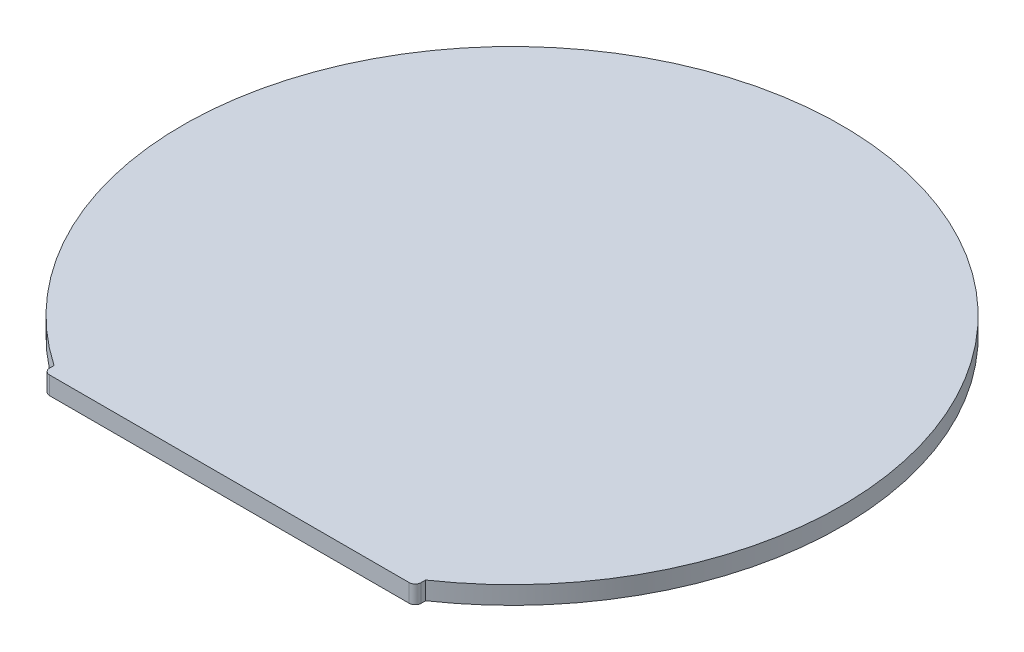
ISO-10303-21;
HEADER;
FILE_DESCRIPTION(('STEP AP214'),'2;1');
FILE_NAME('part.step','',(''),(''),'','','');
FILE_SCHEMA(('AUTOMOTIVE_DESIGN { 1 0 10303 214 1 1 1 1 }'));
ENDSEC;
DATA;
#1=APPLICATION_CONTEXT('core data for automotive mechanical design processes');
#2=APPLICATION_PROTOCOL_DEFINITION('international standard','automotive_design',2000,#1);
#3=PRODUCT_CONTEXT('',#1,'mechanical');
#4=PRODUCT('Part','Part','',(#3));
#5=PRODUCT_RELATED_PRODUCT_CATEGORY('part','',(#4));
#6=PRODUCT_DEFINITION_FORMATION('','',#4);
#7=PRODUCT_DEFINITION_CONTEXT('part definition',#1,'design');
#8=PRODUCT_DEFINITION('design','',#6,#7);
#9=PRODUCT_DEFINITION_SHAPE('','',#8);
#10=(LENGTH_UNIT() NAMED_UNIT(*) SI_UNIT(.MILLI.,.METRE.));
#11=(NAMED_UNIT(*) PLANE_ANGLE_UNIT() SI_UNIT($,.RADIAN.));
#12=(NAMED_UNIT(*) SI_UNIT($,.STERADIAN.) SOLID_ANGLE_UNIT());
#13=UNCERTAINTY_MEASURE_WITH_UNIT(LENGTH_MEASURE(1.E-05),#10,'distance_accuracy_value','');
#14=(GEOMETRIC_REPRESENTATION_CONTEXT(3) GLOBAL_UNCERTAINTY_ASSIGNED_CONTEXT((#13)) GLOBAL_UNIT_ASSIGNED_CONTEXT((#10,
#11,#12)) REPRESENTATION_CONTEXT('',''));
#15=CARTESIAN_POINT('',(0.,0.,0.));
#16=DIRECTION('',(0.,0.,1.));
#17=DIRECTION('',(1.,0.,0.));
#18=AXIS2_PLACEMENT_3D('',#15,#16,#17);
#19=CARTESIAN_POINT('',(-15.5,1.5,23.5849528301415));
#20=DIRECTION('',(1.,0.,0.));
#21=DIRECTION('',(0.,0.,-1.));
#22=AXIS2_PLACEMENT_3D('',#19,#20,#21);
#23=PLANE('',#22);
#24=DIRECTION('',(0.,0.,1.));
#25=VECTOR('',#24,1.);
#26=CARTESIAN_POINT('',(-15.5,0.,23.5849528301415));
#27=LINE('',#26,#25);
#28=CARTESIAN_POINT('',(-15.5,0.,22.7156333832011));
#29=VERTEX_POINT('',#28);
#30=CARTESIAN_POINT('',(-15.5,0.,23.0849528301415));
#31=VERTEX_POINT('',#30);
#32=EDGE_CURVE('E132',#29,#31,#27,.T.);
#33=ORIENTED_EDGE('',*,*,#32,.T.);
#34=DIRECTION('',(0.,-1.,0.));
#35=VECTOR('',#34,1.);
#36=CARTESIAN_POINT('',(-15.5,1.5,23.0849528301415));
#37=LINE('',#36,#35);
#38=CARTESIAN_POINT('',(-15.5,1.5,23.0849528301415));
#39=VERTEX_POINT('',#38);
#40=EDGE_CURVE('E11',#31,#39,#37,.F.);
#41=ORIENTED_EDGE('',*,*,#40,.T.);
#42=DIRECTION('',(0.,0.,1.));
#43=VECTOR('',#42,1.);
#44=CARTESIAN_POINT('',(-15.5,1.5,23.5849528301415));
#45=LINE('',#44,#43);
#46=CARTESIAN_POINT('',(-15.5,1.5,22.7156333832011));
#47=VERTEX_POINT('',#46);
#48=EDGE_CURVE('E142',#47,#39,#45,.T.);
#49=ORIENTED_EDGE('',*,*,#48,.F.);
#50=DIRECTION('',(0.,-1.,0.));
#51=VECTOR('',#50,1.);
#52=CARTESIAN_POINT('',(-15.5,1.5,22.7156333832011));
#53=LINE('',#52,#51);
#54=EDGE_CURVE('E122',#47,#29,#53,.T.);
#55=ORIENTED_EDGE('',*,*,#54,.T.);
#56=EDGE_LOOP('',(#33,#41,#49,#55));
#57=FACE_BOUND('',#56,.T.);
#58=ADVANCED_FACE('F45',(#57),#23,.F.);
#59=CARTESIAN_POINT('',(-15.5,1.5,23.5849528301415));
#60=DIRECTION('',(0.,0.,-1.));
#61=DIRECTION('',(-1.,0.,0.));
#62=AXIS2_PLACEMENT_3D('',#59,#60,#61);
#63=PLANE('',#62);
#64=DIRECTION('',(1.,0.,0.));
#65=VECTOR('',#64,1.);
#66=CARTESIAN_POINT('',(-15.5,0.,23.5849528301415));
#67=LINE('',#66,#65);
#68=CARTESIAN_POINT('',(-15.,0.,23.5849528301415));
#69=VERTEX_POINT('',#68);
#70=CARTESIAN_POINT('',(15.,0.,23.5849528301415));
#71=VERTEX_POINT('',#70);
#72=EDGE_CURVE('E135',#69,#71,#67,.T.);
#73=ORIENTED_EDGE('',*,*,#72,.T.);
#74=DIRECTION('',(0.,-1.,0.));
#75=VECTOR('',#74,1.);
#76=CARTESIAN_POINT('',(15.,1.5,23.5849528301415));
#77=LINE('',#76,#75);
#78=CARTESIAN_POINT('',(15.,1.5,23.5849528301415));
#79=VERTEX_POINT('',#78);
#80=EDGE_CURVE('E67',#71,#79,#77,.F.);
#81=ORIENTED_EDGE('',*,*,#80,.T.);
#82=DIRECTION('',(1.,0.,0.));
#83=VECTOR('',#82,1.);
#84=CARTESIAN_POINT('',(-15.5,1.5,23.5849528301415));
#85=LINE('',#84,#83);
#86=CARTESIAN_POINT('',(-15.,1.5,23.5849528301415));
#87=VERTEX_POINT('',#86);
#88=EDGE_CURVE('E111',#87,#79,#85,.T.);
#89=ORIENTED_EDGE('',*,*,#88,.F.);
#90=DIRECTION('',(0.,-1.,0.));
#91=VECTOR('',#90,1.);
#92=CARTESIAN_POINT('',(-15.,1.5,23.5849528301415));
#93=LINE('',#92,#91);
#94=EDGE_CURVE('E152',#87,#69,#93,.T.);
#95=ORIENTED_EDGE('',*,*,#94,.T.);
#96=EDGE_LOOP('',(#73,#81,#89,#95));
#97=FACE_BOUND('',#96,.T.);
#98=ADVANCED_FACE('F164',(#97),#63,.F.);
#99=CARTESIAN_POINT('',(15.5,1.5,23.5849528301415));
#100=DIRECTION('',(-1.,0.,0.));
#101=DIRECTION('',(0.,0.,1.));
#102=AXIS2_PLACEMENT_3D('',#99,#100,#101);
#103=PLANE('',#102);
#104=DIRECTION('',(0.,0.,-1.));
#105=VECTOR('',#104,1.);
#106=CARTESIAN_POINT('',(15.5,1.5,23.5849528301415));
#107=LINE('',#106,#105);
#108=CARTESIAN_POINT('',(15.5,1.5,23.0849528301415));
#109=VERTEX_POINT('',#108);
#110=CARTESIAN_POINT('',(15.5,1.5,22.7156333832011));
#111=VERTEX_POINT('',#110);
#112=EDGE_CURVE('E100',#109,#111,#107,.T.);
#113=ORIENTED_EDGE('',*,*,#112,.F.);
#114=DIRECTION('',(0.,-1.,0.));
#115=VECTOR('',#114,1.);
#116=CARTESIAN_POINT('',(15.5,1.5,23.0849528301415));
#117=LINE('',#116,#115);
#118=CARTESIAN_POINT('',(15.5,0.,23.0849528301415));
#119=VERTEX_POINT('',#118);
#120=EDGE_CURVE('E121',#109,#119,#117,.T.);
#121=ORIENTED_EDGE('',*,*,#120,.T.);
#122=DIRECTION('',(0.,0.,-1.));
#123=VECTOR('',#122,1.);
#124=CARTESIAN_POINT('',(15.5,0.,23.5849528301415));
#125=LINE('',#124,#123);
#126=CARTESIAN_POINT('',(15.5,0.,22.7156333832011));
#127=VERTEX_POINT('',#126);
#128=EDGE_CURVE('E117',#119,#127,#125,.T.);
#129=ORIENTED_EDGE('',*,*,#128,.T.);
#130=DIRECTION('',(0.,-1.,0.));
#131=VECTOR('',#130,1.);
#132=CARTESIAN_POINT('',(15.5,1.5,22.7156333832011));
#133=LINE('',#132,#131);
#134=EDGE_CURVE('E114',#111,#127,#133,.T.);
#135=ORIENTED_EDGE('',*,*,#134,.F.);
#136=EDGE_LOOP('',(#113,#121,#129,#135));
#137=FACE_BOUND('',#136,.T.);
#138=ADVANCED_FACE('F115',(#137),#103,.F.);
#139=CARTESIAN_POINT('',(0.,1.5,0.));
#140=DIRECTION('',(0.,-1.,0.));
#141=DIRECTION('',(0.,0.,-1.));
#142=AXIS2_PLACEMENT_3D('',#139,#140,#141);
#143=CYLINDRICAL_SURFACE('',#142,27.5);
#144=CARTESIAN_POINT('',(0.,0.,0.));
#145=DIRECTION('',(0.,1.,0.));
#146=DIRECTION('',(0.,0.,1.));
#147=AXIS2_PLACEMENT_3D('',#144,#145,#146);
#148=CIRCLE('',#147,27.5);
#149=EDGE_CURVE('E140',#127,#29,#148,.T.);
#150=ORIENTED_EDGE('',*,*,#149,.T.);
#151=ORIENTED_EDGE('',*,*,#54,.F.);
#152=CARTESIAN_POINT('',(0.,1.5,0.));
#153=DIRECTION('',(0.,1.,0.));
#154=DIRECTION('',(0.,0.,1.));
#155=AXIS2_PLACEMENT_3D('',#152,#153,#154);
#156=CIRCLE('',#155,27.5);
#157=EDGE_CURVE('E104',#111,#47,#156,.T.);
#158=ORIENTED_EDGE('',*,*,#157,.F.);
#159=ORIENTED_EDGE('',*,*,#134,.T.);
#160=EDGE_LOOP('',(#150,#151,#158,#159));
#161=FACE_BOUND('',#160,.T.);
#162=ADVANCED_FACE('F124',(#161),#143,.T.);
#163=CARTESIAN_POINT('',(0.,1.5,0.));
#164=DIRECTION('',(0.,1.,0.));
#165=DIRECTION('',(0.,0.,1.));
#166=AXIS2_PLACEMENT_3D('',#163,#164,#165);
#167=PLANE('',#166);
#168=ORIENTED_EDGE('',*,*,#88,.T.);
#169=CARTESIAN_POINT('',(15.,1.5,23.0849528301415));
#170=DIRECTION('',(0.,1.,0.));
#171=DIRECTION('',(0.,0.,1.));
#172=AXIS2_PLACEMENT_3D('',#169,#170,#171);
#173=CIRCLE('',#172,0.5);
#174=EDGE_CURVE('E54',#79,#109,#173,.T.);
#175=ORIENTED_EDGE('',*,*,#174,.T.);
#176=ORIENTED_EDGE('',*,*,#112,.T.);
#177=ORIENTED_EDGE('',*,*,#157,.T.);
#178=ORIENTED_EDGE('',*,*,#48,.T.);
#179=CARTESIAN_POINT('',(-15.,1.5,23.0849528301415));
#180=DIRECTION('',(0.,1.,0.));
#181=DIRECTION('',(0.,0.,1.));
#182=AXIS2_PLACEMENT_3D('',#179,#180,#181);
#183=CIRCLE('',#182,0.5);
#184=EDGE_CURVE('E158',#39,#87,#183,.T.);
#185=ORIENTED_EDGE('',*,*,#184,.T.);
#186=EDGE_LOOP('',(#168,#175,#176,#177,#178,#185));
#187=FACE_BOUND('',#186,.T.);
#188=ADVANCED_FACE('F102',(#187),#167,.T.);
#189=CARTESIAN_POINT('',(0.,0.,0.));
#190=DIRECTION('',(0.,1.,0.));
#191=DIRECTION('',(0.,0.,1.));
#192=AXIS2_PLACEMENT_3D('',#189,#190,#191);
#193=PLANE('',#192);
#194=ORIENTED_EDGE('',*,*,#128,.F.);
#195=CARTESIAN_POINT('',(15.,0.,23.0849528301415));
#196=DIRECTION('',(0.,1.,0.));
#197=DIRECTION('',(0.,0.,1.));
#198=AXIS2_PLACEMENT_3D('',#195,#196,#197);
#199=CIRCLE('',#198,0.5);
#200=EDGE_CURVE('E149',#119,#71,#199,.F.);
#201=ORIENTED_EDGE('',*,*,#200,.T.);
#202=ORIENTED_EDGE('',*,*,#72,.F.);
#203=CARTESIAN_POINT('',(-15.,0.,23.0849528301415));
#204=DIRECTION('',(0.,1.,0.));
#205=DIRECTION('',(0.,0.,1.));
#206=AXIS2_PLACEMENT_3D('',#203,#204,#205);
#207=CIRCLE('',#206,0.5);
#208=EDGE_CURVE('E146',#69,#31,#207,.F.);
#209=ORIENTED_EDGE('',*,*,#208,.T.);
#210=ORIENTED_EDGE('',*,*,#32,.F.);
#211=ORIENTED_EDGE('',*,*,#149,.F.);
#212=EDGE_LOOP('',(#194,#201,#202,#209,#210,#211));
#213=FACE_BOUND('',#212,.T.);
#214=ADVANCED_FACE('F169',(#213),#193,.F.);
#215=CARTESIAN_POINT('',(15.,1.5,23.0849528301415));
#216=DIRECTION('',(0.,-1.,0.));
#217=DIRECTION('',(0.,0.,-1.));
#218=AXIS2_PLACEMENT_3D('',#215,#216,#217);
#219=CYLINDRICAL_SURFACE('',#218,0.5);
#220=ORIENTED_EDGE('',*,*,#174,.F.);
#221=ORIENTED_EDGE('',*,*,#80,.F.);
#222=ORIENTED_EDGE('',*,*,#200,.F.);
#223=ORIENTED_EDGE('',*,*,#120,.F.);
#224=EDGE_LOOP('',(#220,#221,#222,#223));
#225=FACE_BOUND('',#224,.T.);
#226=ADVANCED_FACE('F179',(#225),#219,.T.);
#227=CARTESIAN_POINT('',(-15.,1.5,23.0849528301415));
#228=DIRECTION('',(0.,-1.,0.));
#229=DIRECTION('',(0.,0.,-1.));
#230=AXIS2_PLACEMENT_3D('',#227,#228,#229);
#231=CYLINDRICAL_SURFACE('',#230,0.5);
#232=ORIENTED_EDGE('',*,*,#184,.F.);
#233=ORIENTED_EDGE('',*,*,#40,.F.);
#234=ORIENTED_EDGE('',*,*,#208,.F.);
#235=ORIENTED_EDGE('',*,*,#94,.F.);
#236=EDGE_LOOP('',(#232,#233,#234,#235));
#237=FACE_BOUND('',#236,.T.);
#238=ADVANCED_FACE('F47',(#237),#231,.T.);
#239=CLOSED_SHELL('',(#58,#98,#138,#162,#188,#214,#226,#238));
#240=MANIFOLD_SOLID_BREP('B2',#239);
#241=ADVANCED_BREP_SHAPE_REPRESENTATION('',(#18,#240),#14);
#242=SHAPE_DEFINITION_REPRESENTATION(#9,#241);
ENDSEC;
END-ISO-10303-21;
